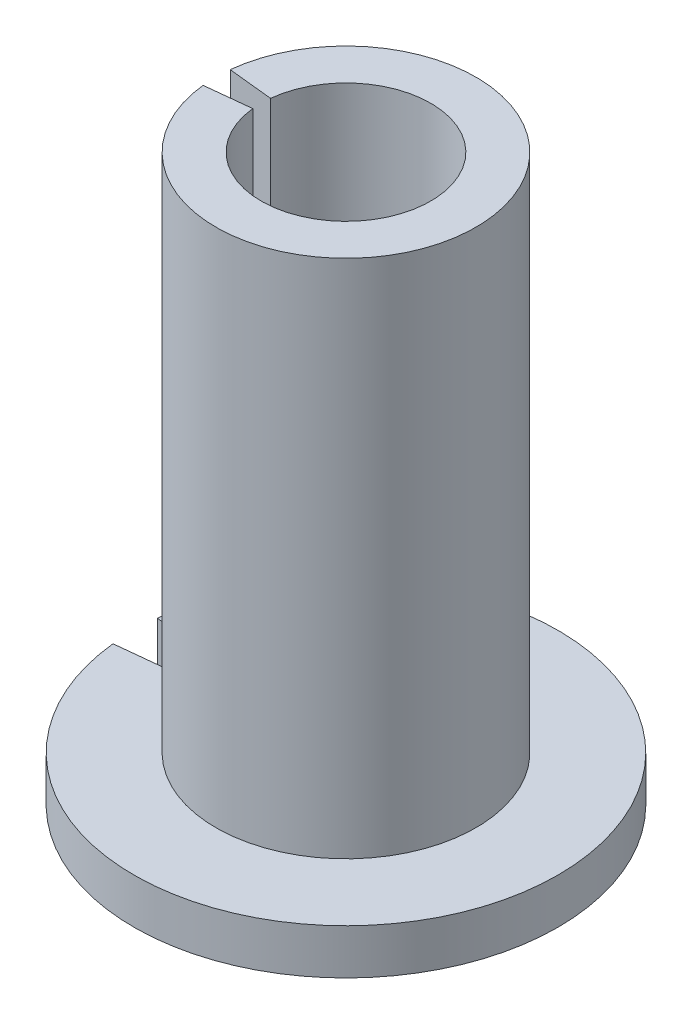
ISO-10303-21;
HEADER;
FILE_DESCRIPTION(('STEP AP214'),'2;1');
FILE_NAME('part.step','',(''),(''),'','','');
FILE_SCHEMA(('AUTOMOTIVE_DESIGN { 1 0 10303 214 1 1 1 1 }'));
ENDSEC;
DATA;
#1=APPLICATION_CONTEXT('core data for automotive mechanical design processes');
#2=APPLICATION_PROTOCOL_DEFINITION('international standard','automotive_design',2000,#1);
#3=PRODUCT_CONTEXT('',#1,'mechanical');
#4=PRODUCT('Part','Part','',(#3));
#5=PRODUCT_RELATED_PRODUCT_CATEGORY('part','',(#4));
#6=PRODUCT_DEFINITION_FORMATION('','',#4);
#7=PRODUCT_DEFINITION_CONTEXT('part definition',#1,'design');
#8=PRODUCT_DEFINITION('design','',#6,#7);
#9=PRODUCT_DEFINITION_SHAPE('','',#8);
#10=(LENGTH_UNIT() NAMED_UNIT(*) SI_UNIT(.MILLI.,.METRE.));
#11=(NAMED_UNIT(*) PLANE_ANGLE_UNIT() SI_UNIT($,.RADIAN.));
#12=(NAMED_UNIT(*) SI_UNIT($,.STERADIAN.) SOLID_ANGLE_UNIT());
#13=UNCERTAINTY_MEASURE_WITH_UNIT(LENGTH_MEASURE(1.E-05),#10,'distance_accuracy_value','');
#14=(GEOMETRIC_REPRESENTATION_CONTEXT(3) GLOBAL_UNCERTAINTY_ASSIGNED_CONTEXT((#13)) GLOBAL_UNIT_ASSIGNED_CONTEXT((#10,
#11,#12)) REPRESENTATION_CONTEXT('',''));
#15=CARTESIAN_POINT('',(0.,0.,0.));
#16=DIRECTION('',(0.,0.,1.));
#17=DIRECTION('',(1.,0.,0.));
#18=AXIS2_PLACEMENT_3D('',#15,#16,#17);
#19=CARTESIAN_POINT('',(-4.57480071869406,20.,-0.480830931031175));
#20=DIRECTION('',(0.,1.,0.));
#21=DIRECTION('',(0.,0.,1.));
#22=AXIS2_PLACEMENT_3D('',#19,#20,#21);
#23=PLANE('',#22);
#24=CARTESIAN_POINT('',(0.,20.,0.));
#25=DIRECTION('',(0.,-1.,0.));
#26=DIRECTION('',(0.,0.,-1.));
#27=AXIS2_PLACEMENT_3D('',#24,#25,#26);
#28=CIRCLE('',#27,3.);
#29=CARTESIAN_POINT('',(-2.98356568610482,20.,-0.31358538980294));
#30=VERTEX_POINT('',#29);
#31=CARTESIAN_POINT('',(-2.98356568610482,20.,0.31358538980294));
#32=VERTEX_POINT('',#31);
#33=EDGE_CURVE('E11',#30,#32,#28,.T.);
#34=ORIENTED_EDGE('',*,*,#33,.T.);
#35=DIRECTION('',(0.994521895368274,0.,-0.104528463267647));
#36=VECTOR('',#35,1.);
#37=CARTESIAN_POINT('',(-4.57480071869406,20.,0.480830931031175));
#38=LINE('',#37,#36);
#39=CARTESIAN_POINT('',(-4.57480071869406,20.,0.480830931031175));
#40=VERTEX_POINT('',#39);
#41=EDGE_CURVE('E92',#40,#32,#38,.T.);
#42=ORIENTED_EDGE('',*,*,#41,.F.);
#43=CARTESIAN_POINT('',(0.,20.,0.));
#44=DIRECTION('',(0.,-1.,0.));
#45=DIRECTION('',(0.,0.,-1.));
#46=AXIS2_PLACEMENT_3D('',#43,#44,#45);
#47=CIRCLE('',#46,4.6);
#48=CARTESIAN_POINT('',(-4.57480071869406,20.,-0.480830931031175));
#49=VERTEX_POINT('',#48);
#50=EDGE_CURVE('E55',#49,#40,#47,.T.);
#51=ORIENTED_EDGE('',*,*,#50,.F.);
#52=DIRECTION('',(0.994521895368274,0.,0.104528463267647));
#53=VECTOR('',#52,1.);
#54=CARTESIAN_POINT('',(-4.57480071869406,20.,-0.480830931031175));
#55=LINE('',#54,#53);
#56=EDGE_CURVE('E94',#49,#30,#55,.T.);
#57=ORIENTED_EDGE('',*,*,#56,.T.);
#58=EDGE_LOOP('',(#34,#42,#51,#57));
#59=FACE_BOUND('',#58,.T.);
#60=ADVANCED_FACE('F40',(#59),#23,.T.);
#61=CARTESIAN_POINT('',(0.,0.,0.));
#62=DIRECTION('',(0.,-1.,0.));
#63=DIRECTION('',(0.,0.,-1.));
#64=AXIS2_PLACEMENT_3D('',#61,#62,#63);
#65=CYLINDRICAL_SURFACE('',#64,3.);
#66=CARTESIAN_POINT('',(0.,0.,0.));
#67=DIRECTION('',(0.,-1.,0.));
#68=DIRECTION('',(0.,0.,-1.));
#69=AXIS2_PLACEMENT_3D('',#66,#67,#68);
#70=CIRCLE('',#69,3.00000000000001);
#71=CARTESIAN_POINT('',(-2.98356568610483,0.,-0.313585389802941));
#72=VERTEX_POINT('',#71);
#73=CARTESIAN_POINT('',(-2.98356568610483,0.,0.313585389802941));
#74=VERTEX_POINT('',#73);
#75=EDGE_CURVE('E48',#72,#74,#70,.T.);
#76=ORIENTED_EDGE('',*,*,#75,.T.);
#77=DIRECTION('',(0.,-1.,0.));
#78=VECTOR('',#77,1.);
#79=CARTESIAN_POINT('',(-2.98356568610482,20.,0.31358538980294));
#80=LINE('',#79,#78);
#81=EDGE_CURVE('E103',#32,#74,#80,.T.);
#82=ORIENTED_EDGE('',*,*,#81,.F.);
#83=ORIENTED_EDGE('',*,*,#33,.F.);
#84=DIRECTION('',(0.,-1.,0.));
#85=VECTOR('',#84,1.);
#86=CARTESIAN_POINT('',(-2.98356568610482,20.,-0.31358538980294));
#87=LINE('',#86,#85);
#88=EDGE_CURVE('E119',#30,#72,#87,.T.);
#89=ORIENTED_EDGE('',*,*,#88,.T.);
#90=EDGE_LOOP('',(#76,#82,#83,#89));
#91=FACE_BOUND('',#90,.T.);
#92=ADVANCED_FACE('F42',(#91),#65,.F.);
#93=CARTESIAN_POINT('',(-2.98356568610483,0.,-0.313585389802941));
#94=DIRECTION('',(0.,-1.,0.));
#95=DIRECTION('',(0.,0.,-1.));
#96=AXIS2_PLACEMENT_3D('',#93,#94,#95);
#97=PLANE('',#96);
#98=CARTESIAN_POINT('',(0.,0.,0.));
#99=DIRECTION('',(0.,-1.,0.));
#100=DIRECTION('',(0.,0.,-1.));
#101=AXIS2_PLACEMENT_3D('',#98,#99,#100);
#102=CIRCLE('',#101,7.5);
#103=CARTESIAN_POINT('',(-7.45891421526205,0.,-0.78396347450735));
#104=VERTEX_POINT('',#103);
#105=CARTESIAN_POINT('',(-7.45891421526206,0.,0.78396347450735));
#106=VERTEX_POINT('',#105);
#107=EDGE_CURVE('E135',#104,#106,#102,.T.);
#108=ORIENTED_EDGE('',*,*,#107,.T.);
#109=DIRECTION('',(-0.994521895368274,0.,0.104528463267647));
#110=VECTOR('',#109,1.);
#111=CARTESIAN_POINT('',(-2.98356568610483,0.,0.313585389802941));
#112=LINE('',#111,#110);
#113=EDGE_CURVE('E108',#74,#106,#112,.T.);
#114=ORIENTED_EDGE('',*,*,#113,.F.);
#115=ORIENTED_EDGE('',*,*,#75,.F.);
#116=DIRECTION('',(-0.994521895368274,0.,-0.104528463267647));
#117=VECTOR('',#116,1.);
#118=CARTESIAN_POINT('',(-2.98356568610483,0.,-0.313585389802941));
#119=LINE('',#118,#117);
#120=EDGE_CURVE('E121',#72,#104,#119,.T.);
#121=ORIENTED_EDGE('',*,*,#120,.T.);
#122=EDGE_LOOP('',(#108,#114,#115,#121));
#123=FACE_BOUND('',#122,.T.);
#124=ADVANCED_FACE('F137',(#123),#97,.T.);
#125=CARTESIAN_POINT('',(0.,0.,0.));
#126=DIRECTION('',(0.,-1.,0.));
#127=DIRECTION('',(0.,0.,-1.));
#128=AXIS2_PLACEMENT_3D('',#125,#126,#127);
#129=CYLINDRICAL_SURFACE('',#128,7.5);
#130=CARTESIAN_POINT('',(0.,1.6,0.));
#131=DIRECTION('',(0.,-1.,0.));
#132=DIRECTION('',(0.,0.,-1.));
#133=AXIS2_PLACEMENT_3D('',#130,#131,#132);
#134=CIRCLE('',#133,7.5);
#135=CARTESIAN_POINT('',(-7.45891421526205,1.6,-0.78396347450735));
#136=VERTEX_POINT('',#135);
#137=CARTESIAN_POINT('',(-7.45891421526206,1.6,0.78396347450735));
#138=VERTEX_POINT('',#137);
#139=EDGE_CURVE('E133',#136,#138,#134,.T.);
#140=ORIENTED_EDGE('',*,*,#139,.T.);
#141=DIRECTION('',(0.,1.,0.));
#142=VECTOR('',#141,1.);
#143=CARTESIAN_POINT('',(-7.45891421526206,0.,0.78396347450735));
#144=LINE('',#143,#142);
#145=EDGE_CURVE('E110',#106,#138,#144,.T.);
#146=ORIENTED_EDGE('',*,*,#145,.F.);
#147=ORIENTED_EDGE('',*,*,#107,.F.);
#148=DIRECTION('',(0.,1.,0.));
#149=VECTOR('',#148,1.);
#150=CARTESIAN_POINT('',(-7.45891421526205,0.,-0.78396347450735));
#151=LINE('',#150,#149);
#152=EDGE_CURVE('E124',#104,#136,#151,.T.);
#153=ORIENTED_EDGE('',*,*,#152,.T.);
#154=EDGE_LOOP('',(#140,#146,#147,#153));
#155=FACE_BOUND('',#154,.T.);
#156=ADVANCED_FACE('F143',(#155),#129,.T.);
#157=CARTESIAN_POINT('',(-7.45891421526205,1.6,-0.78396347450735));
#158=DIRECTION('',(0.,1.,0.));
#159=DIRECTION('',(0.,0.,1.));
#160=AXIS2_PLACEMENT_3D('',#157,#158,#159);
#161=PLANE('',#160);
#162=CARTESIAN_POINT('',(0.,1.6,0.));
#163=DIRECTION('',(0.,-1.,0.));
#164=DIRECTION('',(0.,0.,-1.));
#165=AXIS2_PLACEMENT_3D('',#162,#163,#164);
#166=CIRCLE('',#165,4.6);
#167=CARTESIAN_POINT('',(-4.57480071869406,1.6,-0.480830931031175));
#168=VERTEX_POINT('',#167);
#169=CARTESIAN_POINT('',(-4.57480071869406,1.6,0.480830931031175));
#170=VERTEX_POINT('',#169);
#171=EDGE_CURVE('E63',#168,#170,#166,.T.);
#172=ORIENTED_EDGE('',*,*,#171,.T.);
#173=DIRECTION('',(0.994521895368274,0.,-0.104528463267647));
#174=VECTOR('',#173,1.);
#175=CARTESIAN_POINT('',(-7.45891421526206,1.6,0.78396347450735));
#176=LINE('',#175,#174);
#177=EDGE_CURVE('E115',#138,#170,#176,.T.);
#178=ORIENTED_EDGE('',*,*,#177,.F.);
#179=ORIENTED_EDGE('',*,*,#139,.F.);
#180=DIRECTION('',(0.994521895368274,0.,0.104528463267647));
#181=VECTOR('',#180,1.);
#182=CARTESIAN_POINT('',(-7.45891421526205,1.6,-0.78396347450735));
#183=LINE('',#182,#181);
#184=EDGE_CURVE('E127',#136,#168,#183,.T.);
#185=ORIENTED_EDGE('',*,*,#184,.T.);
#186=EDGE_LOOP('',(#172,#178,#179,#185));
#187=FACE_BOUND('',#186,.T.);
#188=ADVANCED_FACE('F146',(#187),#161,.T.);
#189=CARTESIAN_POINT('',(0.,0.,0.));
#190=DIRECTION('',(0.,-1.,0.));
#191=DIRECTION('',(0.,0.,-1.));
#192=AXIS2_PLACEMENT_3D('',#189,#190,#191);
#193=CYLINDRICAL_SURFACE('',#192,4.6);
#194=DIRECTION('',(0.,1.,0.));
#195=VECTOR('',#194,1.);
#196=CARTESIAN_POINT('',(-4.57480071869406,1.6,-0.480830931031175));
#197=LINE('',#196,#195);
#198=EDGE_CURVE('E129',#168,#49,#197,.T.);
#199=ORIENTED_EDGE('',*,*,#198,.T.);
#200=ORIENTED_EDGE('',*,*,#50,.T.);
#201=DIRECTION('',(0.,1.,0.));
#202=VECTOR('',#201,1.);
#203=CARTESIAN_POINT('',(-4.57480071869406,1.6,0.480830931031175));
#204=LINE('',#203,#202);
#205=EDGE_CURVE('E106',#170,#40,#204,.T.);
#206=ORIENTED_EDGE('',*,*,#205,.F.);
#207=ORIENTED_EDGE('',*,*,#171,.F.);
#208=EDGE_LOOP('',(#199,#200,#206,#207));
#209=FACE_BOUND('',#208,.T.);
#210=ADVANCED_FACE('F148',(#209),#193,.T.);
#211=CARTESIAN_POINT('',(0.,0.,0.));
#212=DIRECTION('',(0.104528463267647,0.,-0.994521895368274));
#213=DIRECTION('',(-0.994521895368274,0.,-0.104528463267647));
#214=AXIS2_PLACEMENT_3D('',#211,#212,#213);
#215=PLANE('',#214);
#216=ORIENTED_EDGE('',*,*,#56,.F.);
#217=ORIENTED_EDGE('',*,*,#198,.F.);
#218=ORIENTED_EDGE('',*,*,#184,.F.);
#219=ORIENTED_EDGE('',*,*,#152,.F.);
#220=ORIENTED_EDGE('',*,*,#120,.F.);
#221=ORIENTED_EDGE('',*,*,#88,.F.);
#222=EDGE_LOOP('',(#216,#217,#218,#219,#220,#221));
#223=FACE_BOUND('',#222,.T.);
#224=ADVANCED_FACE('F150',(#223),#215,.F.);
#225=CARTESIAN_POINT('',(0.,0.,0.));
#226=DIRECTION('',(-0.104528463267647,0.,-0.994521895368274));
#227=DIRECTION('',(-0.994521895368274,0.,0.104528463267647));
#228=AXIS2_PLACEMENT_3D('',#225,#226,#227);
#229=PLANE('',#228);
#230=ORIENTED_EDGE('',*,*,#41,.T.);
#231=ORIENTED_EDGE('',*,*,#81,.T.);
#232=ORIENTED_EDGE('',*,*,#113,.T.);
#233=ORIENTED_EDGE('',*,*,#145,.T.);
#234=ORIENTED_EDGE('',*,*,#177,.T.);
#235=ORIENTED_EDGE('',*,*,#205,.T.);
#236=EDGE_LOOP('',(#230,#231,#232,#233,#234,#235));
#237=FACE_BOUND('',#236,.T.);
#238=ADVANCED_FACE('F101',(#237),#229,.T.);
#239=CLOSED_SHELL('',(#60,#92,#124,#156,#188,#210,#224,#238));
#240=MANIFOLD_SOLID_BREP('B2',#239);
#241=ADVANCED_BREP_SHAPE_REPRESENTATION('',(#18,#240),#14);
#242=SHAPE_DEFINITION_REPRESENTATION(#9,#241);
ENDSEC;
END-ISO-10303-21;
